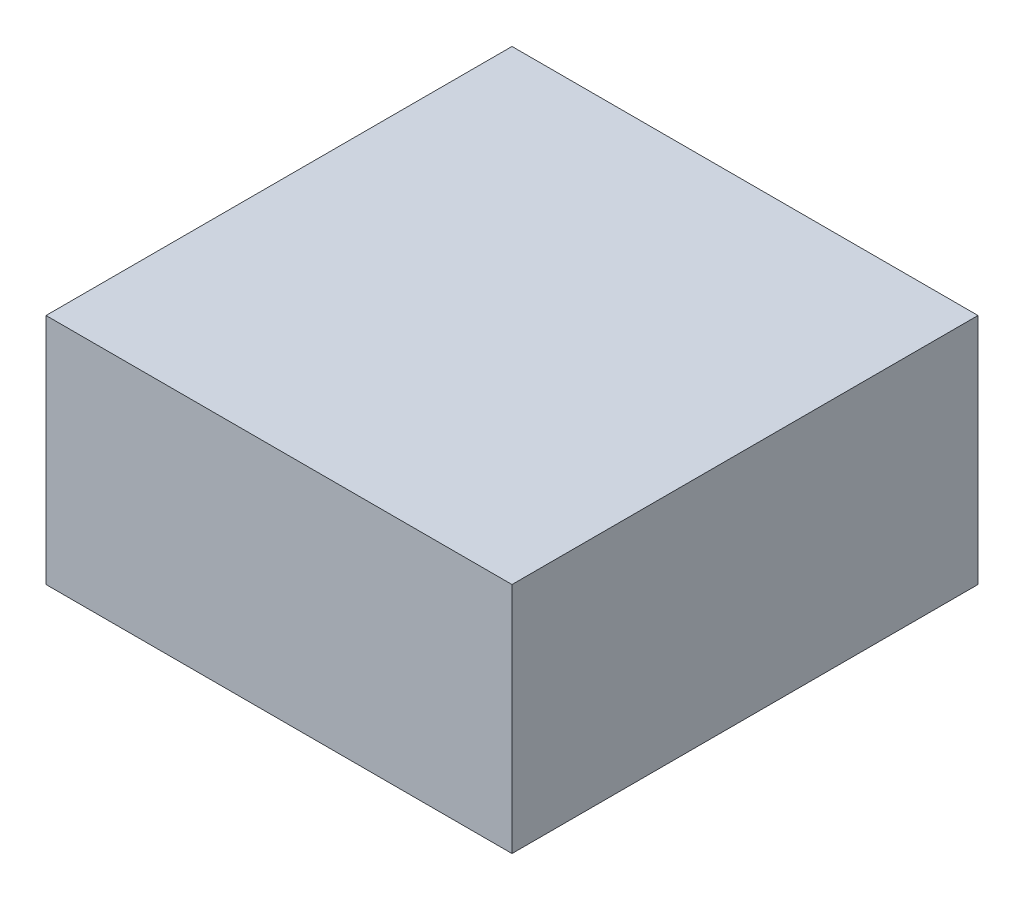
ISO-10303-21;
HEADER;
FILE_DESCRIPTION(('STEP AP214'),'2;1');
FILE_NAME('part.step','',(''),(''),'','','');
FILE_SCHEMA(('AUTOMOTIVE_DESIGN { 1 0 10303 214 1 1 1 1 }'));
ENDSEC;
DATA;
#1=APPLICATION_CONTEXT('core data for automotive mechanical design processes');
#2=APPLICATION_PROTOCOL_DEFINITION('international standard','automotive_design',2000,#1);
#3=PRODUCT_CONTEXT('',#1,'mechanical');
#4=PRODUCT('Part','Part','',(#3));
#5=PRODUCT_RELATED_PRODUCT_CATEGORY('part','',(#4));
#6=PRODUCT_DEFINITION_FORMATION('','',#4);
#7=PRODUCT_DEFINITION_CONTEXT('part definition',#1,'design');
#8=PRODUCT_DEFINITION('design','',#6,#7);
#9=PRODUCT_DEFINITION_SHAPE('','',#8);
#10=(LENGTH_UNIT() NAMED_UNIT(*) SI_UNIT(.MILLI.,.METRE.));
#11=(NAMED_UNIT(*) PLANE_ANGLE_UNIT() SI_UNIT($,.RADIAN.));
#12=(NAMED_UNIT(*) SI_UNIT($,.STERADIAN.) SOLID_ANGLE_UNIT());
#13=UNCERTAINTY_MEASURE_WITH_UNIT(LENGTH_MEASURE(1.E-05),#10,'distance_accuracy_value','');
#14=(GEOMETRIC_REPRESENTATION_CONTEXT(3) GLOBAL_UNCERTAINTY_ASSIGNED_CONTEXT((#13)) GLOBAL_UNIT_ASSIGNED_CONTEXT((#10,
#11,#12)) REPRESENTATION_CONTEXT('',''));
#15=CARTESIAN_POINT('',(0.,0.,0.));
#16=DIRECTION('',(0.,0.,1.));
#17=DIRECTION('',(1.,0.,0.));
#18=AXIS2_PLACEMENT_3D('',#15,#16,#17);
#19=CARTESIAN_POINT('',(0.,5.,0.));
#20=DIRECTION('',(1.,0.,0.));
#21=DIRECTION('',(0.,0.,-1.));
#22=AXIS2_PLACEMENT_3D('',#19,#20,#21);
#23=PLANE('',#22);
#24=DIRECTION('',(0.,0.,1.));
#25=VECTOR('',#24,1.);
#26=CARTESIAN_POINT('',(0.,0.,0.));
#27=LINE('',#26,#25);
#28=CARTESIAN_POINT('',(0.,0.,-10.));
#29=VERTEX_POINT('',#28);
#30=CARTESIAN_POINT('',(0.,0.,0.));
#31=VERTEX_POINT('',#30);
#32=EDGE_CURVE('E96',#29,#31,#27,.T.);
#33=ORIENTED_EDGE('',*,*,#32,.T.);
#34=DIRECTION('',(0.,-1.,0.));
#35=VECTOR('',#34,1.);
#36=CARTESIAN_POINT('',(0.,5.,0.));
#37=LINE('',#36,#35);
#38=CARTESIAN_POINT('',(0.,5.,0.));
#39=VERTEX_POINT('',#38);
#40=EDGE_CURVE('E11',#39,#31,#37,.T.);
#41=ORIENTED_EDGE('',*,*,#40,.F.);
#42=DIRECTION('',(0.,0.,1.));
#43=VECTOR('',#42,1.);
#44=CARTESIAN_POINT('',(0.,5.,0.));
#45=LINE('',#44,#43);
#46=CARTESIAN_POINT('',(0.,5.,-10.));
#47=VERTEX_POINT('',#46);
#48=EDGE_CURVE('E84',#47,#39,#45,.T.);
#49=ORIENTED_EDGE('',*,*,#48,.F.);
#50=DIRECTION('',(0.,-1.,0.));
#51=VECTOR('',#50,1.);
#52=CARTESIAN_POINT('',(0.,5.,-10.));
#53=LINE('',#52,#51);
#54=EDGE_CURVE('E92',#47,#29,#53,.T.);
#55=ORIENTED_EDGE('',*,*,#54,.T.);
#56=EDGE_LOOP('',(#33,#41,#49,#55));
#57=FACE_BOUND('',#56,.T.);
#58=ADVANCED_FACE('F33',(#57),#23,.F.);
#59=CARTESIAN_POINT('',(0.,5.,0.));
#60=DIRECTION('',(0.,0.,-1.));
#61=DIRECTION('',(-1.,0.,0.));
#62=AXIS2_PLACEMENT_3D('',#59,#60,#61);
#63=PLANE('',#62);
#64=DIRECTION('',(1.,0.,0.));
#65=VECTOR('',#64,1.);
#66=CARTESIAN_POINT('',(0.,0.,0.));
#67=LINE('',#66,#65);
#68=CARTESIAN_POINT('',(10.,0.,0.));
#69=VERTEX_POINT('',#68);
#70=EDGE_CURVE('E88',#31,#69,#67,.T.);
#71=ORIENTED_EDGE('',*,*,#70,.T.);
#72=DIRECTION('',(0.,-1.,0.));
#73=VECTOR('',#72,1.);
#74=CARTESIAN_POINT('',(10.,5.,0.));
#75=LINE('',#74,#73);
#76=CARTESIAN_POINT('',(10.,5.,0.));
#77=VERTEX_POINT('',#76);
#78=EDGE_CURVE('E41',#77,#69,#75,.T.);
#79=ORIENTED_EDGE('',*,*,#78,.F.);
#80=DIRECTION('',(1.,0.,0.));
#81=VECTOR('',#80,1.);
#82=CARTESIAN_POINT('',(0.,5.,0.));
#83=LINE('',#82,#81);
#84=EDGE_CURVE('E79',#39,#77,#83,.T.);
#85=ORIENTED_EDGE('',*,*,#84,.F.);
#86=ORIENTED_EDGE('',*,*,#40,.T.);
#87=EDGE_LOOP('',(#71,#79,#85,#86));
#88=FACE_BOUND('',#87,.T.);
#89=ADVANCED_FACE('F87',(#88),#63,.F.);
#90=CARTESIAN_POINT('',(10.,5.,0.));
#91=DIRECTION('',(-1.,0.,0.));
#92=DIRECTION('',(0.,0.,1.));
#93=AXIS2_PLACEMENT_3D('',#90,#91,#92);
#94=PLANE('',#93);
#95=DIRECTION('',(0.,0.,-1.));
#96=VECTOR('',#95,1.);
#97=CARTESIAN_POINT('',(10.,0.,0.));
#98=LINE('',#97,#96);
#99=CARTESIAN_POINT('',(10.,0.,-10.));
#100=VERTEX_POINT('',#99);
#101=EDGE_CURVE('E66',#69,#100,#98,.T.);
#102=ORIENTED_EDGE('',*,*,#101,.T.);
#103=DIRECTION('',(0.,-1.,0.));
#104=VECTOR('',#103,1.);
#105=CARTESIAN_POINT('',(10.,5.,-10.));
#106=LINE('',#105,#104);
#107=CARTESIAN_POINT('',(10.,5.,-10.));
#108=VERTEX_POINT('',#107);
#109=EDGE_CURVE('E89',#108,#100,#106,.T.);
#110=ORIENTED_EDGE('',*,*,#109,.F.);
#111=DIRECTION('',(0.,0.,-1.));
#112=VECTOR('',#111,1.);
#113=CARTESIAN_POINT('',(10.,5.,0.));
#114=LINE('',#113,#112);
#115=EDGE_CURVE('E82',#77,#108,#114,.T.);
#116=ORIENTED_EDGE('',*,*,#115,.F.);
#117=ORIENTED_EDGE('',*,*,#78,.T.);
#118=EDGE_LOOP('',(#102,#110,#116,#117));
#119=FACE_BOUND('',#118,.T.);
#120=ADVANCED_FACE('F90',(#119),#94,.F.);
#121=CARTESIAN_POINT('',(0.,5.,-10.));
#122=DIRECTION('',(0.,0.,1.));
#123=DIRECTION('',(1.,0.,0.));
#124=AXIS2_PLACEMENT_3D('',#121,#122,#123);
#125=PLANE('',#124);
#126=DIRECTION('',(-1.,0.,0.));
#127=VECTOR('',#126,1.);
#128=CARTESIAN_POINT('',(0.,0.,-10.));
#129=LINE('',#128,#127);
#130=EDGE_CURVE('E72',#100,#29,#129,.T.);
#131=ORIENTED_EDGE('',*,*,#130,.T.);
#132=ORIENTED_EDGE('',*,*,#54,.F.);
#133=DIRECTION('',(-1.,0.,0.));
#134=VECTOR('',#133,1.);
#135=CARTESIAN_POINT('',(0.,5.,-10.));
#136=LINE('',#135,#134);
#137=EDGE_CURVE('E49',#108,#47,#136,.T.);
#138=ORIENTED_EDGE('',*,*,#137,.F.);
#139=ORIENTED_EDGE('',*,*,#109,.T.);
#140=EDGE_LOOP('',(#131,#132,#138,#139));
#141=FACE_BOUND('',#140,.T.);
#142=ADVANCED_FACE('F103',(#141),#125,.F.);
#143=CARTESIAN_POINT('',(0.,5.,0.));
#144=DIRECTION('',(0.,-1.,0.));
#145=DIRECTION('',(0.,0.,-1.));
#146=AXIS2_PLACEMENT_3D('',#143,#144,#145);
#147=PLANE('',#146);
#148=ORIENTED_EDGE('',*,*,#48,.T.);
#149=ORIENTED_EDGE('',*,*,#84,.T.);
#150=ORIENTED_EDGE('',*,*,#115,.T.);
#151=ORIENTED_EDGE('',*,*,#137,.T.);
#152=EDGE_LOOP('',(#148,#149,#150,#151));
#153=FACE_BOUND('',#152,.T.);
#154=ADVANCED_FACE('F80',(#153),#147,.F.);
#155=CARTESIAN_POINT('',(0.,0.,0.));
#156=DIRECTION('',(0.,-1.,0.));
#157=DIRECTION('',(0.,0.,-1.));
#158=AXIS2_PLACEMENT_3D('',#155,#156,#157);
#159=PLANE('',#158);
#160=ORIENTED_EDGE('',*,*,#32,.F.);
#161=ORIENTED_EDGE('',*,*,#130,.F.);
#162=ORIENTED_EDGE('',*,*,#101,.F.);
#163=ORIENTED_EDGE('',*,*,#70,.F.);
#164=EDGE_LOOP('',(#160,#161,#162,#163));
#165=FACE_BOUND('',#164,.T.);
#166=ADVANCED_FACE('F106',(#165),#159,.T.);
#167=CLOSED_SHELL('',(#58,#89,#120,#142,#154,#166));
#168=MANIFOLD_SOLID_BREP('B2',#167);
#169=ADVANCED_BREP_SHAPE_REPRESENTATION('',(#18,#168),#14);
#170=SHAPE_DEFINITION_REPRESENTATION(#9,#169);
ENDSEC;
END-ISO-10303-21;
